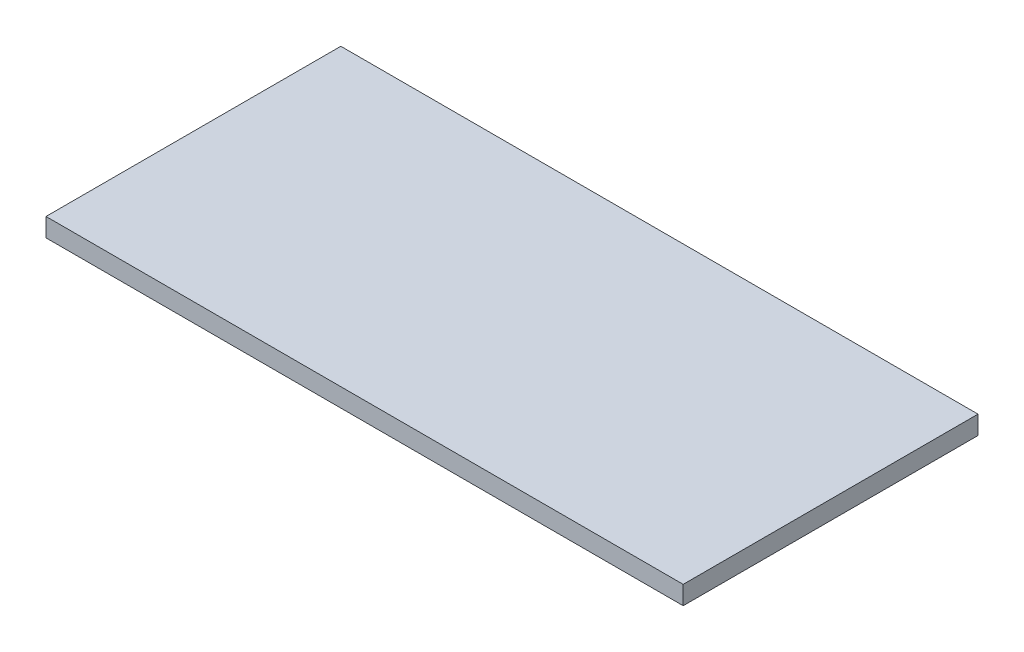
ISO-10303-21;
HEADER;
FILE_DESCRIPTION(('STEP AP214'),'2;1');
FILE_NAME('part.step','',(''),(''),'','','');
FILE_SCHEMA(('AUTOMOTIVE_DESIGN { 1 0 10303 214 1 1 1 1 }'));
ENDSEC;
DATA;
#1=APPLICATION_CONTEXT('core data for automotive mechanical design processes');
#2=APPLICATION_PROTOCOL_DEFINITION('international standard','automotive_design',2000,#1);
#3=PRODUCT_CONTEXT('',#1,'mechanical');
#4=PRODUCT('Part','Part','',(#3));
#5=PRODUCT_RELATED_PRODUCT_CATEGORY('part','',(#4));
#6=PRODUCT_DEFINITION_FORMATION('','',#4);
#7=PRODUCT_DEFINITION_CONTEXT('part definition',#1,'design');
#8=PRODUCT_DEFINITION('design','',#6,#7);
#9=PRODUCT_DEFINITION_SHAPE('','',#8);
#10=(LENGTH_UNIT() NAMED_UNIT(*) SI_UNIT(.MILLI.,.METRE.));
#11=(NAMED_UNIT(*) PLANE_ANGLE_UNIT() SI_UNIT($,.RADIAN.));
#12=(NAMED_UNIT(*) SI_UNIT($,.STERADIAN.) SOLID_ANGLE_UNIT());
#13=UNCERTAINTY_MEASURE_WITH_UNIT(LENGTH_MEASURE(1.E-05),#10,'distance_accuracy_value','');
#14=(GEOMETRIC_REPRESENTATION_CONTEXT(3) GLOBAL_UNCERTAINTY_ASSIGNED_CONTEXT((#13)) GLOBAL_UNIT_ASSIGNED_CONTEXT((#10,
#11,#12)) REPRESENTATION_CONTEXT('',''));
#15=CARTESIAN_POINT('',(0.,0.,0.));
#16=DIRECTION('',(0.,0.,1.));
#17=DIRECTION('',(1.,0.,0.));
#18=AXIS2_PLACEMENT_3D('',#15,#16,#17);
#19=CARTESIAN_POINT('',(0.,0.,62.));
#20=DIRECTION('',(1.,0.,0.));
#21=DIRECTION('',(0.,0.,-1.));
#22=AXIS2_PLACEMENT_3D('',#19,#20,#21);
#23=PLANE('',#22);
#24=DIRECTION('',(0.,-1.,0.));
#25=VECTOR('',#24,1.);
#26=CARTESIAN_POINT('',(0.,0.,0.));
#27=LINE('',#26,#25);
#28=CARTESIAN_POINT('',(0.,3.9,0.));
#29=VERTEX_POINT('',#28);
#30=CARTESIAN_POINT('',(0.,0.,0.));
#31=VERTEX_POINT('',#30);
#32=EDGE_CURVE('E96',#29,#31,#27,.T.);
#33=ORIENTED_EDGE('',*,*,#32,.T.);
#34=DIRECTION('',(0.,0.,-1.));
#35=VECTOR('',#34,1.);
#36=CARTESIAN_POINT('',(0.,0.,62.));
#37=LINE('',#36,#35);
#38=CARTESIAN_POINT('',(0.,0.,62.));
#39=VERTEX_POINT('',#38);
#40=EDGE_CURVE('E11',#39,#31,#37,.T.);
#41=ORIENTED_EDGE('',*,*,#40,.F.);
#42=DIRECTION('',(0.,-1.,0.));
#43=VECTOR('',#42,1.);
#44=CARTESIAN_POINT('',(0.,0.,62.));
#45=LINE('',#44,#43);
#46=CARTESIAN_POINT('',(0.,3.9,62.));
#47=VERTEX_POINT('',#46);
#48=EDGE_CURVE('E84',#47,#39,#45,.T.);
#49=ORIENTED_EDGE('',*,*,#48,.F.);
#50=DIRECTION('',(0.,0.,-1.));
#51=VECTOR('',#50,1.);
#52=CARTESIAN_POINT('',(0.,3.9,62.));
#53=LINE('',#52,#51);
#54=EDGE_CURVE('E92',#47,#29,#53,.T.);
#55=ORIENTED_EDGE('',*,*,#54,.T.);
#56=EDGE_LOOP('',(#33,#41,#49,#55));
#57=FACE_BOUND('',#56,.T.);
#58=ADVANCED_FACE('F33',(#57),#23,.F.);
#59=CARTESIAN_POINT('',(0.,0.,62.));
#60=DIRECTION('',(0.,1.,0.));
#61=DIRECTION('',(0.,0.,1.));
#62=AXIS2_PLACEMENT_3D('',#59,#60,#61);
#63=PLANE('',#62);
#64=DIRECTION('',(1.,0.,0.));
#65=VECTOR('',#64,1.);
#66=CARTESIAN_POINT('',(0.,0.,0.));
#67=LINE('',#66,#65);
#68=CARTESIAN_POINT('',(134.,0.,0.));
#69=VERTEX_POINT('',#68);
#70=EDGE_CURVE('E88',#31,#69,#67,.T.);
#71=ORIENTED_EDGE('',*,*,#70,.T.);
#72=DIRECTION('',(0.,0.,-1.));
#73=VECTOR('',#72,1.);
#74=CARTESIAN_POINT('',(134.,0.,62.));
#75=LINE('',#74,#73);
#76=CARTESIAN_POINT('',(134.,0.,62.));
#77=VERTEX_POINT('',#76);
#78=EDGE_CURVE('E41',#77,#69,#75,.T.);
#79=ORIENTED_EDGE('',*,*,#78,.F.);
#80=DIRECTION('',(1.,0.,0.));
#81=VECTOR('',#80,1.);
#82=CARTESIAN_POINT('',(0.,0.,62.));
#83=LINE('',#82,#81);
#84=EDGE_CURVE('E79',#39,#77,#83,.T.);
#85=ORIENTED_EDGE('',*,*,#84,.F.);
#86=ORIENTED_EDGE('',*,*,#40,.T.);
#87=EDGE_LOOP('',(#71,#79,#85,#86));
#88=FACE_BOUND('',#87,.T.);
#89=ADVANCED_FACE('F87',(#88),#63,.F.);
#90=CARTESIAN_POINT('',(134.,0.,62.));
#91=DIRECTION('',(-1.,0.,0.));
#92=DIRECTION('',(0.,0.,1.));
#93=AXIS2_PLACEMENT_3D('',#90,#91,#92);
#94=PLANE('',#93);
#95=DIRECTION('',(0.,1.,0.));
#96=VECTOR('',#95,1.);
#97=CARTESIAN_POINT('',(134.,0.,0.));
#98=LINE('',#97,#96);
#99=CARTESIAN_POINT('',(134.,3.9,0.));
#100=VERTEX_POINT('',#99);
#101=EDGE_CURVE('E66',#69,#100,#98,.T.);
#102=ORIENTED_EDGE('',*,*,#101,.T.);
#103=DIRECTION('',(0.,0.,-1.));
#104=VECTOR('',#103,1.);
#105=CARTESIAN_POINT('',(134.,3.9,62.));
#106=LINE('',#105,#104);
#107=CARTESIAN_POINT('',(134.,3.9,62.));
#108=VERTEX_POINT('',#107);
#109=EDGE_CURVE('E89',#108,#100,#106,.T.);
#110=ORIENTED_EDGE('',*,*,#109,.F.);
#111=DIRECTION('',(0.,1.,0.));
#112=VECTOR('',#111,1.);
#113=CARTESIAN_POINT('',(134.,0.,62.));
#114=LINE('',#113,#112);
#115=EDGE_CURVE('E82',#77,#108,#114,.T.);
#116=ORIENTED_EDGE('',*,*,#115,.F.);
#117=ORIENTED_EDGE('',*,*,#78,.T.);
#118=EDGE_LOOP('',(#102,#110,#116,#117));
#119=FACE_BOUND('',#118,.T.);
#120=ADVANCED_FACE('F90',(#119),#94,.F.);
#121=CARTESIAN_POINT('',(0.,3.9,62.));
#122=DIRECTION('',(0.,-1.,0.));
#123=DIRECTION('',(0.,0.,-1.));
#124=AXIS2_PLACEMENT_3D('',#121,#122,#123);
#125=PLANE('',#124);
#126=DIRECTION('',(-1.,0.,0.));
#127=VECTOR('',#126,1.);
#128=CARTESIAN_POINT('',(0.,3.9,0.));
#129=LINE('',#128,#127);
#130=EDGE_CURVE('E72',#100,#29,#129,.T.);
#131=ORIENTED_EDGE('',*,*,#130,.T.);
#132=ORIENTED_EDGE('',*,*,#54,.F.);
#133=DIRECTION('',(-1.,0.,0.));
#134=VECTOR('',#133,1.);
#135=CARTESIAN_POINT('',(0.,3.9,62.));
#136=LINE('',#135,#134);
#137=EDGE_CURVE('E49',#108,#47,#136,.T.);
#138=ORIENTED_EDGE('',*,*,#137,.F.);
#139=ORIENTED_EDGE('',*,*,#109,.T.);
#140=EDGE_LOOP('',(#131,#132,#138,#139));
#141=FACE_BOUND('',#140,.T.);
#142=ADVANCED_FACE('F103',(#141),#125,.F.);
#143=CARTESIAN_POINT('',(0.,0.,62.));
#144=DIRECTION('',(0.,0.,-1.));
#145=DIRECTION('',(-1.,0.,0.));
#146=AXIS2_PLACEMENT_3D('',#143,#144,#145);
#147=PLANE('',#146);
#148=ORIENTED_EDGE('',*,*,#48,.T.);
#149=ORIENTED_EDGE('',*,*,#84,.T.);
#150=ORIENTED_EDGE('',*,*,#115,.T.);
#151=ORIENTED_EDGE('',*,*,#137,.T.);
#152=EDGE_LOOP('',(#148,#149,#150,#151));
#153=FACE_BOUND('',#152,.T.);
#154=ADVANCED_FACE('F80',(#153),#147,.F.);
#155=CARTESIAN_POINT('',(0.,0.,0.));
#156=DIRECTION('',(0.,0.,-1.));
#157=DIRECTION('',(-1.,0.,0.));
#158=AXIS2_PLACEMENT_3D('',#155,#156,#157);
#159=PLANE('',#158);
#160=ORIENTED_EDGE('',*,*,#32,.F.);
#161=ORIENTED_EDGE('',*,*,#130,.F.);
#162=ORIENTED_EDGE('',*,*,#101,.F.);
#163=ORIENTED_EDGE('',*,*,#70,.F.);
#164=EDGE_LOOP('',(#160,#161,#162,#163));
#165=FACE_BOUND('',#164,.T.);
#166=ADVANCED_FACE('F106',(#165),#159,.T.);
#167=CLOSED_SHELL('',(#58,#89,#120,#142,#154,#166));
#168=MANIFOLD_SOLID_BREP('B2',#167);
#169=ADVANCED_BREP_SHAPE_REPRESENTATION('',(#18,#168),#14);
#170=SHAPE_DEFINITION_REPRESENTATION(#9,#169);
ENDSEC;
END-ISO-10303-21;
